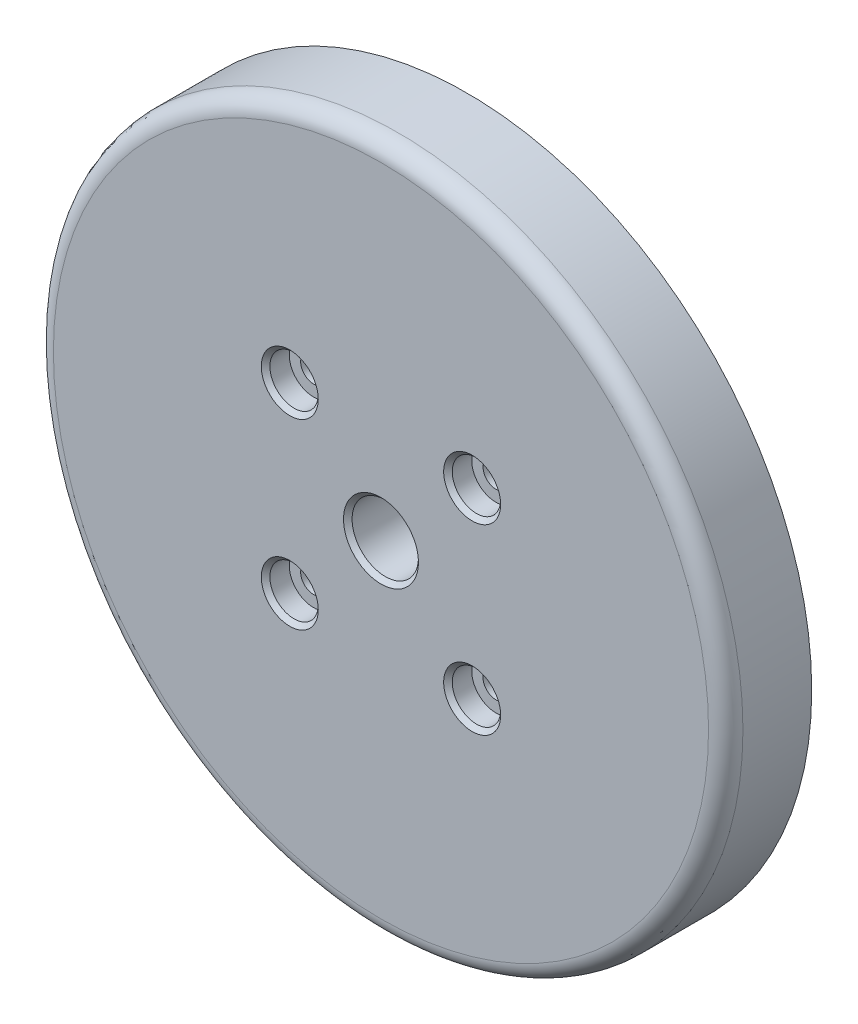
ISO-10303-21;
HEADER;
FILE_DESCRIPTION(('STEP AP214'),'2;1');
FILE_NAME('part.step','',(''),(''),'','','');
FILE_SCHEMA(('AUTOMOTIVE_DESIGN { 1 0 10303 214 1 1 1 1 }'));
ENDSEC;
DATA;
#1=APPLICATION_CONTEXT('core data for automotive mechanical design processes');
#2=APPLICATION_PROTOCOL_DEFINITION('international standard','automotive_design',2000,#1);
#3=PRODUCT_CONTEXT('',#1,'mechanical');
#4=PRODUCT('Part','Part','',(#3));
#5=PRODUCT_RELATED_PRODUCT_CATEGORY('part','',(#4));
#6=PRODUCT_DEFINITION_FORMATION('','',#4);
#7=PRODUCT_DEFINITION_CONTEXT('part definition',#1,'design');
#8=PRODUCT_DEFINITION('design','',#6,#7);
#9=PRODUCT_DEFINITION_SHAPE('','',#8);
#10=(LENGTH_UNIT() NAMED_UNIT(*) SI_UNIT(.MILLI.,.METRE.));
#11=(NAMED_UNIT(*) PLANE_ANGLE_UNIT() SI_UNIT($,.RADIAN.));
#12=(NAMED_UNIT(*) SI_UNIT($,.STERADIAN.) SOLID_ANGLE_UNIT());
#13=UNCERTAINTY_MEASURE_WITH_UNIT(LENGTH_MEASURE(1.E-05),#10,'distance_accuracy_value','');
#14=(GEOMETRIC_REPRESENTATION_CONTEXT(3) GLOBAL_UNCERTAINTY_ASSIGNED_CONTEXT((#13)) GLOBAL_UNIT_ASSIGNED_CONTEXT((#10,
#11,#12)) REPRESENTATION_CONTEXT('',''));
#15=CARTESIAN_POINT('',(0.,0.,0.));
#16=DIRECTION('',(0.,0.,1.));
#17=DIRECTION('',(1.,0.,0.));
#18=AXIS2_PLACEMENT_3D('',#15,#16,#17);
#19=CARTESIAN_POINT('',(0.,0.,12.7));
#20=DIRECTION('',(0.,0.,1.));
#21=DIRECTION('',(1.,0.,0.));
#22=AXIS2_PLACEMENT_3D('',#19,#20,#21);
#23=CYLINDRICAL_SURFACE('',#22,4.90219999999999);
#24=CARTESIAN_POINT('',(0.,0.,12.065));
#25=DIRECTION('',(0.,0.,1.));
#26=DIRECTION('',(1.,0.,0.));
#27=AXIS2_PLACEMENT_3D('',#24,#25,#26);
#28=CIRCLE('',#27,4.9022);
#29=CARTESIAN_POINT('',(4.9022,0.,12.065));
#30=VERTEX_POINT('',#29);
#31=EDGE_CURVE('E49',#30,#30,#28,.T.);
#32=ORIENTED_EDGE('',*,*,#31,.T.);
#33=EDGE_LOOP('',(#32));
#34=FACE_BOUND('',#33,.T.);
#35=CARTESIAN_POINT('',(0.,0.,4.826));
#36=DIRECTION('',(0.,0.,-1.));
#37=DIRECTION('',(-1.,0.,0.));
#38=AXIS2_PLACEMENT_3D('',#35,#36,#37);
#39=CIRCLE('',#38,4.90219999999999);
#40=CARTESIAN_POINT('',(-4.90219999999999,0.,4.826));
#41=VERTEX_POINT('',#40);
#42=EDGE_CURVE('E109',#41,#41,#39,.F.);
#43=ORIENTED_EDGE('',*,*,#42,.F.);
#44=EDGE_LOOP('',(#43));
#45=FACE_BOUND('',#44,.T.);
#46=ADVANCED_FACE('F32',(#34,#45),#23,.F.);
#47=CARTESIAN_POINT('',(13.4703841816037,-13.4703841816037,12.7));
#48=DIRECTION('',(0.,0.,1.));
#49=DIRECTION('',(1.,0.,0.));
#50=AXIS2_PLACEMENT_3D('',#47,#48,#49);
#51=CYLINDRICAL_SURFACE('',#50,1.89865);
#52=CARTESIAN_POINT('',(13.4703841816037,-13.4703841816037,9.1948));
#53=DIRECTION('',(0.,0.,1.));
#54=DIRECTION('',(1.,0.,0.));
#55=AXIS2_PLACEMENT_3D('',#52,#53,#54);
#56=CIRCLE('',#55,1.89865);
#57=CARTESIAN_POINT('',(15.3690341816037,-13.4703841816037,9.1948));
#58=VERTEX_POINT('',#57);
#59=EDGE_CURVE('E55',#58,#58,#56,.T.);
#60=ORIENTED_EDGE('',*,*,#59,.T.);
#61=EDGE_LOOP('',(#60));
#62=FACE_BOUND('',#61,.T.);
#63=CARTESIAN_POINT('',(13.4703841816037,-13.4703841816037,4.826));
#64=DIRECTION('',(0.,0.,-1.));
#65=DIRECTION('',(-1.,0.,0.));
#66=AXIS2_PLACEMENT_3D('',#63,#64,#65);
#67=CIRCLE('',#66,1.89865);
#68=CARTESIAN_POINT('',(11.5717341816037,-13.4703841816037,4.826));
#69=VERTEX_POINT('',#68);
#70=EDGE_CURVE('E112',#69,#69,#67,.F.);
#71=ORIENTED_EDGE('',*,*,#70,.F.);
#72=EDGE_LOOP('',(#71));
#73=FACE_BOUND('',#72,.T.);
#74=ADVANCED_FACE('F147',(#62,#73),#51,.F.);
#75=CARTESIAN_POINT('',(-13.4703841816037,13.4703841816037,12.7));
#76=DIRECTION('',(0.,0.,1.));
#77=DIRECTION('',(1.,0.,0.));
#78=AXIS2_PLACEMENT_3D('',#75,#76,#77);
#79=CYLINDRICAL_SURFACE('',#78,1.89865);
#80=CARTESIAN_POINT('',(-13.4703841816037,13.4703841816037,9.1948));
#81=DIRECTION('',(0.,0.,1.));
#82=DIRECTION('',(1.,0.,0.));
#83=AXIS2_PLACEMENT_3D('',#80,#81,#82);
#84=CIRCLE('',#83,1.89865);
#85=CARTESIAN_POINT('',(-11.5717341816037,13.4703841816037,9.1948));
#86=VERTEX_POINT('',#85);
#87=EDGE_CURVE('E67',#86,#86,#84,.T.);
#88=ORIENTED_EDGE('',*,*,#87,.T.);
#89=EDGE_LOOP('',(#88));
#90=FACE_BOUND('',#89,.T.);
#91=CARTESIAN_POINT('',(-13.4703841816037,13.4703841816037,4.826));
#92=DIRECTION('',(0.,0.,-1.));
#93=DIRECTION('',(-1.,0.,0.));
#94=AXIS2_PLACEMENT_3D('',#91,#92,#93);
#95=CIRCLE('',#94,1.89865);
#96=CARTESIAN_POINT('',(-15.3690341816037,13.4703841816037,4.826));
#97=VERTEX_POINT('',#96);
#98=EDGE_CURVE('E115',#97,#97,#95,.F.);
#99=ORIENTED_EDGE('',*,*,#98,.F.);
#100=EDGE_LOOP('',(#99));
#101=FACE_BOUND('',#100,.T.);
#102=ADVANCED_FACE('F153',(#90,#101),#79,.F.);
#103=CARTESIAN_POINT('',(-13.4703841816037,-13.4703841816037,12.7));
#104=DIRECTION('',(0.,0.,1.));
#105=DIRECTION('',(1.,0.,0.));
#106=AXIS2_PLACEMENT_3D('',#103,#104,#105);
#107=CYLINDRICAL_SURFACE('',#106,1.89865);
#108=CARTESIAN_POINT('',(-13.4703841816037,-13.4703841816037,9.1948));
#109=DIRECTION('',(0.,0.,1.));
#110=DIRECTION('',(1.,0.,0.));
#111=AXIS2_PLACEMENT_3D('',#108,#109,#110);
#112=CIRCLE('',#111,1.89865);
#113=CARTESIAN_POINT('',(-11.5717341816037,-13.4703841816037,9.1948));
#114=VERTEX_POINT('',#113);
#115=EDGE_CURVE('E79',#114,#114,#112,.T.);
#116=ORIENTED_EDGE('',*,*,#115,.T.);
#117=EDGE_LOOP('',(#116));
#118=FACE_BOUND('',#117,.T.);
#119=CARTESIAN_POINT('',(-13.4703841816037,-13.4703841816037,4.826));
#120=DIRECTION('',(0.,0.,-1.));
#121=DIRECTION('',(-1.,0.,0.));
#122=AXIS2_PLACEMENT_3D('',#119,#120,#121);
#123=CIRCLE('',#122,1.89865);
#124=CARTESIAN_POINT('',(-15.3690341816037,-13.4703841816037,4.826));
#125=VERTEX_POINT('',#124);
#126=EDGE_CURVE('E118',#125,#125,#123,.F.);
#127=ORIENTED_EDGE('',*,*,#126,.F.);
#128=EDGE_LOOP('',(#127));
#129=FACE_BOUND('',#128,.T.);
#130=ADVANCED_FACE('F172',(#118,#129),#107,.F.);
#131=CARTESIAN_POINT('',(13.4703841816037,13.4703841816037,12.7));
#132=DIRECTION('',(0.,0.,1.));
#133=DIRECTION('',(1.,0.,0.));
#134=AXIS2_PLACEMENT_3D('',#131,#132,#133);
#135=CYLINDRICAL_SURFACE('',#134,1.89865);
#136=CARTESIAN_POINT('',(13.4703841816037,13.4703841816037,9.1948));
#137=DIRECTION('',(0.,0.,1.));
#138=DIRECTION('',(1.,0.,0.));
#139=AXIS2_PLACEMENT_3D('',#136,#137,#138);
#140=CIRCLE('',#139,1.89865);
#141=CARTESIAN_POINT('',(15.3690341816037,13.4703841816037,9.1948));
#142=VERTEX_POINT('',#141);
#143=EDGE_CURVE('E91',#142,#142,#140,.T.);
#144=ORIENTED_EDGE('',*,*,#143,.T.);
#145=EDGE_LOOP('',(#144));
#146=FACE_BOUND('',#145,.T.);
#147=CARTESIAN_POINT('',(13.4703841816037,13.4703841816037,4.826));
#148=DIRECTION('',(0.,0.,-1.));
#149=DIRECTION('',(-1.,0.,0.));
#150=AXIS2_PLACEMENT_3D('',#147,#148,#149);
#151=CIRCLE('',#150,1.89865);
#152=CARTESIAN_POINT('',(11.5717341816037,13.4703841816037,4.826));
#153=VERTEX_POINT('',#152);
#154=EDGE_CURVE('E121',#153,#153,#151,.F.);
#155=ORIENTED_EDGE('',*,*,#154,.F.);
#156=EDGE_LOOP('',(#155));
#157=FACE_BOUND('',#156,.T.);
#158=ADVANCED_FACE('F168',(#146,#157),#135,.F.);
#159=CARTESIAN_POINT('',(0.,0.,12.7));
#160=DIRECTION('',(0.,0.,-1.));
#161=DIRECTION('',(-1.,0.,0.));
#162=AXIS2_PLACEMENT_3D('',#159,#160,#161);
#163=CYLINDRICAL_SURFACE('',#162,50.927);
#164=CARTESIAN_POINT('',(0.,0.,10.16));
#165=DIRECTION('',(0.,0.,1.));
#166=DIRECTION('',(1.,0.,0.));
#167=AXIS2_PLACEMENT_3D('',#164,#165,#166);
#168=CIRCLE('',#167,50.927);
#169=CARTESIAN_POINT('',(50.927,0.,10.16));
#170=VERTEX_POINT('',#169);
#171=EDGE_CURVE('E10',#170,#170,#168,.F.);
#172=ORIENTED_EDGE('',*,*,#171,.T.);
#173=EDGE_LOOP('',(#172));
#174=FACE_BOUND('',#173,.T.);
#175=CARTESIAN_POINT('',(0.,0.,0.));
#176=DIRECTION('',(0.,0.,1.));
#177=DIRECTION('',(1.,0.,0.));
#178=AXIS2_PLACEMENT_3D('',#175,#176,#177);
#179=CIRCLE('',#178,50.927);
#180=CARTESIAN_POINT('',(50.927,0.,0.));
#181=VERTEX_POINT('',#180);
#182=EDGE_CURVE('E44',#181,#181,#179,.T.);
#183=ORIENTED_EDGE('',*,*,#182,.T.);
#184=EDGE_LOOP('',(#183));
#185=FACE_BOUND('',#184,.T.);
#186=ADVANCED_FACE('F163',(#174,#185),#163,.T.);
#187=CARTESIAN_POINT('',(0.,0.,12.7));
#188=DIRECTION('',(0.,0.,1.));
#189=DIRECTION('',(1.,0.,0.));
#190=AXIS2_PLACEMENT_3D('',#187,#188,#189);
#191=PLANE('',#190);
#192=CARTESIAN_POINT('',(0.,0.,12.7));
#193=DIRECTION('',(0.,0.,1.));
#194=DIRECTION('',(1.,0.,0.));
#195=AXIS2_PLACEMENT_3D('',#192,#193,#194);
#196=CIRCLE('',#195,48.387);
#197=CARTESIAN_POINT('',(48.387,0.,12.7));
#198=VERTEX_POINT('',#197);
#199=EDGE_CURVE('E40',#198,#198,#196,.T.);
#200=ORIENTED_EDGE('',*,*,#199,.T.);
#201=EDGE_LOOP('',(#200));
#202=FACE_BOUND('',#201,.T.);
#203=CARTESIAN_POINT('',(13.4703841816037,13.4703841816037,12.7));
#204=DIRECTION('',(0.,0.,1.));
#205=DIRECTION('',(1.,0.,0.));
#206=AXIS2_PLACEMENT_3D('',#203,#204,#205);
#207=CIRCLE('',#206,4.20751);
#208=CARTESIAN_POINT('',(17.6778941816037,13.4703841816037,12.7));
#209=VERTEX_POINT('',#208);
#210=EDGE_CURVE('E100',#209,#209,#207,.T.);
#211=ORIENTED_EDGE('',*,*,#210,.F.);
#212=EDGE_LOOP('',(#211));
#213=FACE_BOUND('',#212,.T.);
#214=CARTESIAN_POINT('',(-13.4703841816037,-13.4703841816037,12.7));
#215=DIRECTION('',(0.,0.,1.));
#216=DIRECTION('',(1.,0.,0.));
#217=AXIS2_PLACEMENT_3D('',#214,#215,#216);
#218=CIRCLE('',#217,4.20751);
#219=CARTESIAN_POINT('',(-9.26287418160373,-13.4703841816037,12.7));
#220=VERTEX_POINT('',#219);
#221=EDGE_CURVE('E88',#220,#220,#218,.T.);
#222=ORIENTED_EDGE('',*,*,#221,.F.);
#223=EDGE_LOOP('',(#222));
#224=FACE_BOUND('',#223,.T.);
#225=CARTESIAN_POINT('',(-13.4703841816037,13.4703841816037,12.7));
#226=DIRECTION('',(0.,0.,1.));
#227=DIRECTION('',(1.,0.,0.));
#228=AXIS2_PLACEMENT_3D('',#225,#226,#227);
#229=CIRCLE('',#228,4.20751);
#230=CARTESIAN_POINT('',(-9.26287418160373,13.4703841816037,12.7));
#231=VERTEX_POINT('',#230);
#232=EDGE_CURVE('E76',#231,#231,#229,.T.);
#233=ORIENTED_EDGE('',*,*,#232,.F.);
#234=EDGE_LOOP('',(#233));
#235=FACE_BOUND('',#234,.T.);
#236=CARTESIAN_POINT('',(13.4703841816037,-13.4703841816037,12.7));
#237=DIRECTION('',(0.,0.,1.));
#238=DIRECTION('',(1.,0.,0.));
#239=AXIS2_PLACEMENT_3D('',#236,#237,#238);
#240=CIRCLE('',#239,4.20751);
#241=CARTESIAN_POINT('',(17.6778941816037,-13.4703841816037,12.7));
#242=VERTEX_POINT('',#241);
#243=EDGE_CURVE('E64',#242,#242,#240,.T.);
#244=ORIENTED_EDGE('',*,*,#243,.F.);
#245=EDGE_LOOP('',(#244));
#246=FACE_BOUND('',#245,.T.);
#247=CARTESIAN_POINT('',(0.,0.,12.7));
#248=DIRECTION('',(0.,0.,1.));
#249=DIRECTION('',(1.,0.,0.));
#250=AXIS2_PLACEMENT_3D('',#247,#248,#249);
#251=CIRCLE('',#250,5.5372);
#252=CARTESIAN_POINT('',(5.5372,0.,12.7));
#253=VERTEX_POINT('',#252);
#254=EDGE_CURVE('E52',#253,#253,#251,.T.);
#255=ORIENTED_EDGE('',*,*,#254,.F.);
#256=EDGE_LOOP('',(#255));
#257=FACE_BOUND('',#256,.T.);
#258=ADVANCED_FACE('F159',(#202,#213,#224,#235,#246,#257),#191,.T.);
#259=CARTESIAN_POINT('',(0.,0.,0.));
#260=DIRECTION('',(0.,0.,1.));
#261=DIRECTION('',(1.,0.,0.));
#262=AXIS2_PLACEMENT_3D('',#259,#260,#261);
#263=PLANE('',#262);
#264=CARTESIAN_POINT('',(0.,0.,0.));
#265=DIRECTION('',(0.,0.,-1.));
#266=DIRECTION('',(-1.,0.,0.));
#267=AXIS2_PLACEMENT_3D('',#264,#265,#266);
#268=CIRCLE('',#267,38.1);
#269=CARTESIAN_POINT('',(-38.1,0.,0.));
#270=VERTEX_POINT('',#269);
#271=EDGE_CURVE('E127',#270,#270,#268,.T.);
#272=ORIENTED_EDGE('',*,*,#271,.F.);
#273=EDGE_LOOP('',(#272));
#274=FACE_BOUND('',#273,.T.);
#275=ORIENTED_EDGE('',*,*,#182,.F.);
#276=EDGE_LOOP('',(#275));
#277=FACE_BOUND('',#276,.T.);
#278=ADVANCED_FACE('F162',(#274,#277),#263,.F.);
#279=CARTESIAN_POINT('',(0.,0.,12.7));
#280=DIRECTION('',(0.,0.,1.));
#281=DIRECTION('',(1.,0.,0.));
#282=AXIS2_PLACEMENT_3D('',#279,#280,#281);
#283=CONICAL_SURFACE('',#282,5.5372,0.785398163397448);
#284=ORIENTED_EDGE('',*,*,#31,.F.);
#285=EDGE_LOOP('',(#284));
#286=FACE_BOUND('',#285,.T.);
#287=ORIENTED_EDGE('',*,*,#254,.T.);
#288=EDGE_LOOP('',(#287));
#289=FACE_BOUND('',#288,.T.);
#290=ADVANCED_FACE('F158',(#286,#289),#283,.F.);
#291=CARTESIAN_POINT('',(17.0428941816037,-13.4703841816037,9.1948));
#292=DIRECTION('',(0.,0.,-1.));
#293=DIRECTION('',(-1.,0.,0.));
#294=AXIS2_PLACEMENT_3D('',#291,#292,#293);
#295=PLANE('',#294);
#296=ORIENTED_EDGE('',*,*,#59,.F.);
#297=EDGE_LOOP('',(#296));
#298=FACE_BOUND('',#297,.T.);
#299=CARTESIAN_POINT('',(13.4703841816037,-13.4703841816037,9.1948));
#300=DIRECTION('',(0.,0.,1.));
#301=DIRECTION('',(1.,0.,0.));
#302=AXIS2_PLACEMENT_3D('',#299,#300,#301);
#303=CIRCLE('',#302,3.57251);
#304=CARTESIAN_POINT('',(17.0428941816037,-13.4703841816037,9.1948));
#305=VERTEX_POINT('',#304);
#306=EDGE_CURVE('E58',#305,#305,#303,.T.);
#307=ORIENTED_EDGE('',*,*,#306,.T.);
#308=EDGE_LOOP('',(#307));
#309=FACE_BOUND('',#308,.T.);
#310=ADVANCED_FACE('F222',(#298,#309),#295,.F.);
#311=CARTESIAN_POINT('',(13.4703841816037,-13.4703841816037,12.7));
#312=DIRECTION('',(0.,0.,1.));
#313=DIRECTION('',(1.,0.,0.));
#314=AXIS2_PLACEMENT_3D('',#311,#312,#313);
#315=CYLINDRICAL_SURFACE('',#314,3.57251);
#316=ORIENTED_EDGE('',*,*,#306,.F.);
#317=EDGE_LOOP('',(#316));
#318=FACE_BOUND('',#317,.T.);
#319=CARTESIAN_POINT('',(13.4703841816037,-13.4703841816037,12.065));
#320=DIRECTION('',(0.,0.,1.));
#321=DIRECTION('',(1.,0.,0.));
#322=AXIS2_PLACEMENT_3D('',#319,#320,#321);
#323=CIRCLE('',#322,3.57251);
#324=CARTESIAN_POINT('',(17.0428941816037,-13.4703841816037,12.065));
#325=VERTEX_POINT('',#324);
#326=EDGE_CURVE('E61',#325,#325,#323,.T.);
#327=ORIENTED_EDGE('',*,*,#326,.T.);
#328=EDGE_LOOP('',(#327));
#329=FACE_BOUND('',#328,.T.);
#330=ADVANCED_FACE('F218',(#318,#329),#315,.F.);
#331=CARTESIAN_POINT('',(13.4703841816037,-13.4703841816037,12.7));
#332=DIRECTION('',(0.,0.,1.));
#333=DIRECTION('',(1.,0.,0.));
#334=AXIS2_PLACEMENT_3D('',#331,#332,#333);
#335=CONICAL_SURFACE('',#334,4.20751,0.785398163397451);
#336=ORIENTED_EDGE('',*,*,#326,.F.);
#337=EDGE_LOOP('',(#336));
#338=FACE_BOUND('',#337,.T.);
#339=ORIENTED_EDGE('',*,*,#243,.T.);
#340=EDGE_LOOP('',(#339));
#341=FACE_BOUND('',#340,.T.);
#342=ADVANCED_FACE('F211',(#338,#341),#335,.F.);
#343=CARTESIAN_POINT('',(-9.89787418160373,13.4703841816037,9.1948));
#344=DIRECTION('',(0.,0.,-1.));
#345=DIRECTION('',(-1.,0.,0.));
#346=AXIS2_PLACEMENT_3D('',#343,#344,#345);
#347=PLANE('',#346);
#348=ORIENTED_EDGE('',*,*,#87,.F.);
#349=EDGE_LOOP('',(#348));
#350=FACE_BOUND('',#349,.T.);
#351=CARTESIAN_POINT('',(-13.4703841816037,13.4703841816037,9.1948));
#352=DIRECTION('',(0.,0.,1.));
#353=DIRECTION('',(1.,0.,0.));
#354=AXIS2_PLACEMENT_3D('',#351,#352,#353);
#355=CIRCLE('',#354,3.57251);
#356=CARTESIAN_POINT('',(-9.89787418160373,13.4703841816037,9.1948));
#357=VERTEX_POINT('',#356);
#358=EDGE_CURVE('E70',#357,#357,#355,.T.);
#359=ORIENTED_EDGE('',*,*,#358,.T.);
#360=EDGE_LOOP('',(#359));
#361=FACE_BOUND('',#360,.T.);
#362=ADVANCED_FACE('F207',(#350,#361),#347,.F.);
#363=CARTESIAN_POINT('',(-13.4703841816037,13.4703841816037,12.7));
#364=DIRECTION('',(0.,0.,1.));
#365=DIRECTION('',(1.,0.,0.));
#366=AXIS2_PLACEMENT_3D('',#363,#364,#365);
#367=CYLINDRICAL_SURFACE('',#366,3.57251);
#368=ORIENTED_EDGE('',*,*,#358,.F.);
#369=EDGE_LOOP('',(#368));
#370=FACE_BOUND('',#369,.T.);
#371=CARTESIAN_POINT('',(-13.4703841816037,13.4703841816037,12.065));
#372=DIRECTION('',(0.,0.,1.));
#373=DIRECTION('',(1.,0.,0.));
#374=AXIS2_PLACEMENT_3D('',#371,#372,#373);
#375=CIRCLE('',#374,3.57251);
#376=CARTESIAN_POINT('',(-9.89787418160373,13.4703841816037,12.065));
#377=VERTEX_POINT('',#376);
#378=EDGE_CURVE('E73',#377,#377,#375,.T.);
#379=ORIENTED_EDGE('',*,*,#378,.T.);
#380=EDGE_LOOP('',(#379));
#381=FACE_BOUND('',#380,.T.);
#382=ADVANCED_FACE('F203',(#370,#381),#367,.F.);
#383=CARTESIAN_POINT('',(-13.4703841816037,13.4703841816037,12.7));
#384=DIRECTION('',(0.,0.,1.));
#385=DIRECTION('',(1.,0.,0.));
#386=AXIS2_PLACEMENT_3D('',#383,#384,#385);
#387=CONICAL_SURFACE('',#386,4.20751,0.78539816339745);
#388=ORIENTED_EDGE('',*,*,#378,.F.);
#389=EDGE_LOOP('',(#388));
#390=FACE_BOUND('',#389,.T.);
#391=ORIENTED_EDGE('',*,*,#232,.T.);
#392=EDGE_LOOP('',(#391));
#393=FACE_BOUND('',#392,.T.);
#394=ADVANCED_FACE('F198',(#390,#393),#387,.F.);
#395=CARTESIAN_POINT('',(-9.89787418160373,-13.4703841816037,9.1948));
#396=DIRECTION('',(0.,0.,-1.));
#397=DIRECTION('',(-1.,0.,0.));
#398=AXIS2_PLACEMENT_3D('',#395,#396,#397);
#399=PLANE('',#398);
#400=ORIENTED_EDGE('',*,*,#115,.F.);
#401=EDGE_LOOP('',(#400));
#402=FACE_BOUND('',#401,.T.);
#403=CARTESIAN_POINT('',(-13.4703841816037,-13.4703841816037,9.1948));
#404=DIRECTION('',(0.,0.,1.));
#405=DIRECTION('',(1.,0.,0.));
#406=AXIS2_PLACEMENT_3D('',#403,#404,#405);
#407=CIRCLE('',#406,3.57251);
#408=CARTESIAN_POINT('',(-9.89787418160373,-13.4703841816037,9.1948));
#409=VERTEX_POINT('',#408);
#410=EDGE_CURVE('E82',#409,#409,#407,.T.);
#411=ORIENTED_EDGE('',*,*,#410,.T.);
#412=EDGE_LOOP('',(#411));
#413=FACE_BOUND('',#412,.T.);
#414=ADVANCED_FACE('F195',(#402,#413),#399,.F.);
#415=CARTESIAN_POINT('',(-13.4703841816037,-13.4703841816037,12.7));
#416=DIRECTION('',(0.,0.,1.));
#417=DIRECTION('',(1.,0.,0.));
#418=AXIS2_PLACEMENT_3D('',#415,#416,#417);
#419=CYLINDRICAL_SURFACE('',#418,3.57251);
#420=ORIENTED_EDGE('',*,*,#410,.F.);
#421=EDGE_LOOP('',(#420));
#422=FACE_BOUND('',#421,.T.);
#423=CARTESIAN_POINT('',(-13.4703841816037,-13.4703841816037,12.065));
#424=DIRECTION('',(0.,0.,1.));
#425=DIRECTION('',(1.,0.,0.));
#426=AXIS2_PLACEMENT_3D('',#423,#424,#425);
#427=CIRCLE('',#426,3.57251);
#428=CARTESIAN_POINT('',(-9.89787418160373,-13.4703841816037,12.065));
#429=VERTEX_POINT('',#428);
#430=EDGE_CURVE('E85',#429,#429,#427,.T.);
#431=ORIENTED_EDGE('',*,*,#430,.T.);
#432=EDGE_LOOP('',(#431));
#433=FACE_BOUND('',#432,.T.);
#434=ADVANCED_FACE('F191',(#422,#433),#419,.F.);
#435=CARTESIAN_POINT('',(-13.4703841816037,-13.4703841816037,12.7));
#436=DIRECTION('',(0.,0.,1.));
#437=DIRECTION('',(1.,0.,0.));
#438=AXIS2_PLACEMENT_3D('',#435,#436,#437);
#439=CONICAL_SURFACE('',#438,4.20751,0.78539816339745);
#440=ORIENTED_EDGE('',*,*,#430,.F.);
#441=EDGE_LOOP('',(#440));
#442=FACE_BOUND('',#441,.T.);
#443=ORIENTED_EDGE('',*,*,#221,.T.);
#444=EDGE_LOOP('',(#443));
#445=FACE_BOUND('',#444,.T.);
#446=ADVANCED_FACE('F188',(#442,#445),#439,.F.);
#447=CARTESIAN_POINT('',(17.0428941816037,13.4703841816037,9.1948));
#448=DIRECTION('',(0.,0.,-1.));
#449=DIRECTION('',(-1.,0.,0.));
#450=AXIS2_PLACEMENT_3D('',#447,#448,#449);
#451=PLANE('',#450);
#452=ORIENTED_EDGE('',*,*,#143,.F.);
#453=EDGE_LOOP('',(#452));
#454=FACE_BOUND('',#453,.T.);
#455=CARTESIAN_POINT('',(13.4703841816037,13.4703841816037,9.1948));
#456=DIRECTION('',(0.,0.,1.));
#457=DIRECTION('',(1.,0.,0.));
#458=AXIS2_PLACEMENT_3D('',#455,#456,#457);
#459=CIRCLE('',#458,3.57251);
#460=CARTESIAN_POINT('',(17.0428941816037,13.4703841816037,9.1948));
#461=VERTEX_POINT('',#460);
#462=EDGE_CURVE('E94',#461,#461,#459,.T.);
#463=ORIENTED_EDGE('',*,*,#462,.T.);
#464=EDGE_LOOP('',(#463));
#465=FACE_BOUND('',#464,.T.);
#466=ADVANCED_FACE('F186',(#454,#465),#451,.F.);
#467=CARTESIAN_POINT('',(13.4703841816037,13.4703841816037,12.7));
#468=DIRECTION('',(0.,0.,1.));
#469=DIRECTION('',(1.,0.,0.));
#470=AXIS2_PLACEMENT_3D('',#467,#468,#469);
#471=CYLINDRICAL_SURFACE('',#470,3.57251);
#472=ORIENTED_EDGE('',*,*,#462,.F.);
#473=EDGE_LOOP('',(#472));
#474=FACE_BOUND('',#473,.T.);
#475=CARTESIAN_POINT('',(13.4703841816037,13.4703841816037,12.065));
#476=DIRECTION('',(0.,0.,1.));
#477=DIRECTION('',(1.,0.,0.));
#478=AXIS2_PLACEMENT_3D('',#475,#476,#477);
#479=CIRCLE('',#478,3.57251);
#480=CARTESIAN_POINT('',(17.0428941816037,13.4703841816037,12.065));
#481=VERTEX_POINT('',#480);
#482=EDGE_CURVE('E97',#481,#481,#479,.T.);
#483=ORIENTED_EDGE('',*,*,#482,.T.);
#484=EDGE_LOOP('',(#483));
#485=FACE_BOUND('',#484,.T.);
#486=ADVANCED_FACE('F266',(#474,#485),#471,.F.);
#487=CARTESIAN_POINT('',(13.4703841816037,13.4703841816037,12.7));
#488=DIRECTION('',(0.,0.,1.));
#489=DIRECTION('',(1.,0.,0.));
#490=AXIS2_PLACEMENT_3D('',#487,#488,#489);
#491=CONICAL_SURFACE('',#490,4.20751,0.785398163397451);
#492=ORIENTED_EDGE('',*,*,#482,.F.);
#493=EDGE_LOOP('',(#492));
#494=FACE_BOUND('',#493,.T.);
#495=ORIENTED_EDGE('',*,*,#210,.T.);
#496=EDGE_LOOP('',(#495));
#497=FACE_BOUND('',#496,.T.);
#498=ADVANCED_FACE('F264',(#494,#497),#491,.F.);
#499=CARTESIAN_POINT('',(0.,0.,10.16));
#500=DIRECTION('',(0.,0.,1.));
#501=DIRECTION('',(1.,0.,0.));
#502=AXIS2_PLACEMENT_3D('',#499,#500,#501);
#503=TOROIDAL_SURFACE('',#502,48.387,2.54);
#504=ORIENTED_EDGE('',*,*,#171,.F.);
#505=EDGE_LOOP('',(#504));
#506=FACE_BOUND('',#505,.T.);
#507=ORIENTED_EDGE('',*,*,#199,.F.);
#508=EDGE_LOOP('',(#507));
#509=FACE_BOUND('',#508,.T.);
#510=ADVANCED_FACE('F34',(#506,#509),#503,.T.);
#511=CARTESIAN_POINT('',(0.,0.,4.826));
#512=DIRECTION('',(0.,0.,-1.));
#513=DIRECTION('',(-1.,0.,0.));
#514=AXIS2_PLACEMENT_3D('',#511,#512,#513);
#515=PLANE('',#514);
#516=CARTESIAN_POINT('',(0.,0.,4.826));
#517=DIRECTION('',(0.,0.,-1.));
#518=DIRECTION('',(-1.,0.,0.));
#519=AXIS2_PLACEMENT_3D('',#516,#517,#518);
#520=CIRCLE('',#519,12.446);
#521=CARTESIAN_POINT('',(-12.446,0.,4.826));
#522=VERTEX_POINT('',#521);
#523=EDGE_CURVE('E36',#522,#522,#520,.F.);
#524=ORIENTED_EDGE('',*,*,#523,.F.);
#525=EDGE_LOOP('',(#524));
#526=FACE_BOUND('',#525,.T.);
#527=ORIENTED_EDGE('',*,*,#42,.T.);
#528=EDGE_LOOP('',(#527));
#529=FACE_BOUND('',#528,.T.);
#530=ADVANCED_FACE('F139',(#526,#529),#515,.T.);
#531=CARTESIAN_POINT('',(0.,0.,4.826));
#532=DIRECTION('',(0.,0.,-1.));
#533=DIRECTION('',(-1.,0.,0.));
#534=AXIS2_PLACEMENT_3D('',#531,#532,#533);
#535=CIRCLE('',#534,38.1);
#536=CARTESIAN_POINT('',(-38.1,0.,4.826));
#537=VERTEX_POINT('',#536);
#538=EDGE_CURVE('E130',#537,#537,#535,.T.);
#539=ORIENTED_EDGE('',*,*,#538,.T.);
#540=EDGE_LOOP('',(#539));
#541=FACE_BOUND('',#540,.T.);
#542=CARTESIAN_POINT('',(0.,0.,4.826));
#543=DIRECTION('',(0.,0.,-1.));
#544=DIRECTION('',(-1.,0.,0.));
#545=AXIS2_PLACEMENT_3D('',#542,#543,#544);
#546=CIRCLE('',#545,15.9385);
#547=CARTESIAN_POINT('',(-15.9385,0.,4.826));
#548=VERTEX_POINT('',#547);
#549=EDGE_CURVE('E124',#548,#548,#546,.F.);
#550=ORIENTED_EDGE('',*,*,#549,.T.);
#551=EDGE_LOOP('',(#550));
#552=FACE_BOUND('',#551,.T.);
#553=ORIENTED_EDGE('',*,*,#154,.T.);
#554=EDGE_LOOP('',(#553));
#555=FACE_BOUND('',#554,.T.);
#556=ORIENTED_EDGE('',*,*,#126,.T.);
#557=EDGE_LOOP('',(#556));
#558=FACE_BOUND('',#557,.T.);
#559=ORIENTED_EDGE('',*,*,#98,.T.);
#560=EDGE_LOOP('',(#559));
#561=FACE_BOUND('',#560,.T.);
#562=ORIENTED_EDGE('',*,*,#70,.T.);
#563=EDGE_LOOP('',(#562));
#564=FACE_BOUND('',#563,.T.);
#565=ADVANCED_FACE('F142',(#541,#552,#555,#558,#561,#564),#515,.T.);
#566=CARTESIAN_POINT('',(0.,0.,4.826));
#567=DIRECTION('',(0.,0.,-1.));
#568=DIRECTION('',(-1.,0.,0.));
#569=AXIS2_PLACEMENT_3D('',#566,#567,#568);
#570=CYLINDRICAL_SURFACE('',#569,38.1);
#571=ORIENTED_EDGE('',*,*,#538,.F.);
#572=EDGE_LOOP('',(#571));
#573=FACE_BOUND('',#572,.T.);
#574=ORIENTED_EDGE('',*,*,#271,.T.);
#575=EDGE_LOOP('',(#574));
#576=FACE_BOUND('',#575,.T.);
#577=ADVANCED_FACE('F245',(#573,#576),#570,.F.);
#578=CARTESIAN_POINT('',(0.,0.,6.35));
#579=DIRECTION('',(0.,0.,-1.));
#580=DIRECTION('',(-1.,0.,0.));
#581=AXIS2_PLACEMENT_3D('',#578,#579,#580);
#582=CYLINDRICAL_SURFACE('',#581,15.9385);
#583=CARTESIAN_POINT('',(0.,0.,6.35));
#584=DIRECTION('',(0.,0.,-1.));
#585=DIRECTION('',(-1.,0.,0.));
#586=AXIS2_PLACEMENT_3D('',#583,#584,#585);
#587=CIRCLE('',#586,15.9385);
#588=CARTESIAN_POINT('',(-15.9385,0.,6.35));
#589=VERTEX_POINT('',#588);
#590=EDGE_CURVE('E103',#589,#589,#587,.T.);
#591=ORIENTED_EDGE('',*,*,#590,.F.);
#592=EDGE_LOOP('',(#591));
#593=FACE_BOUND('',#592,.T.);
#594=ORIENTED_EDGE('',*,*,#549,.F.);
#595=EDGE_LOOP('',(#594));
#596=FACE_BOUND('',#595,.T.);
#597=ADVANCED_FACE('F249',(#593,#596),#582,.F.);
#598=CARTESIAN_POINT('',(0.,0.,6.35));
#599=DIRECTION('',(0.,0.,-1.));
#600=DIRECTION('',(-1.,0.,0.));
#601=AXIS2_PLACEMENT_3D('',#598,#599,#600);
#602=PLANE('',#601);
#603=CARTESIAN_POINT('',(0.,0.,6.35));
#604=DIRECTION('',(0.,0.,-1.));
#605=DIRECTION('',(-1.,0.,0.));
#606=AXIS2_PLACEMENT_3D('',#603,#604,#605);
#607=CIRCLE('',#606,12.446);
#608=CARTESIAN_POINT('',(-12.446,0.,6.35));
#609=VERTEX_POINT('',#608);
#610=EDGE_CURVE('E106',#609,#609,#607,.T.);
#611=ORIENTED_EDGE('',*,*,#610,.F.);
#612=EDGE_LOOP('',(#611));
#613=FACE_BOUND('',#612,.T.);
#614=ORIENTED_EDGE('',*,*,#590,.T.);
#615=EDGE_LOOP('',(#614));
#616=FACE_BOUND('',#615,.T.);
#617=ADVANCED_FACE('F256',(#613,#616),#602,.T.);
#618=CARTESIAN_POINT('',(0.,0.,6.35));
#619=DIRECTION('',(0.,0.,-1.));
#620=DIRECTION('',(-1.,0.,0.));
#621=AXIS2_PLACEMENT_3D('',#618,#619,#620);
#622=CYLINDRICAL_SURFACE('',#621,12.446);
#623=ORIENTED_EDGE('',*,*,#610,.T.);
#624=EDGE_LOOP('',(#623));
#625=FACE_BOUND('',#624,.T.);
#626=ORIENTED_EDGE('',*,*,#523,.T.);
#627=EDGE_LOOP('',(#626));
#628=FACE_BOUND('',#627,.T.);
#629=ADVANCED_FACE('F137',(#625,#628),#622,.T.);
#630=CLOSED_SHELL('',(#46,#74,#102,#130,#158,#186,#258,#278,#290,#310,#330,#342,#362,#382,#394,
#414,#434,#446,#466,#486,#498,#510,#530,#565,#577,#597,#617,#629));
#631=MANIFOLD_SOLID_BREP('B2',#630);
#632=ADVANCED_BREP_SHAPE_REPRESENTATION('',(#18,#631),#14);
#633=SHAPE_DEFINITION_REPRESENTATION(#9,#632);
ENDSEC;
END-ISO-10303-21;
